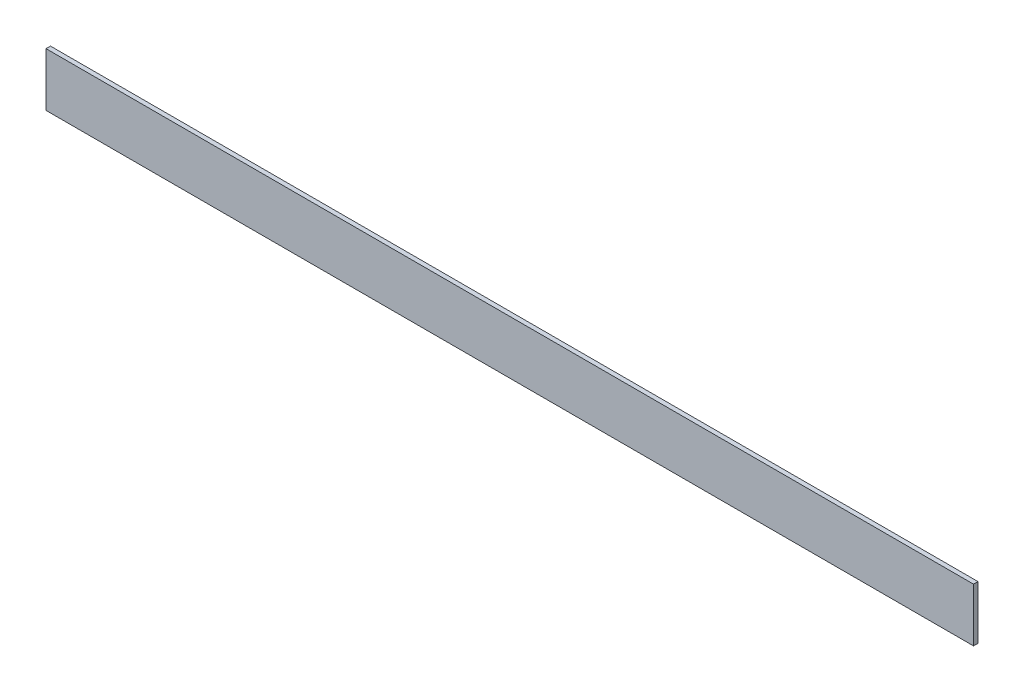
ISO-10303-21;
HEADER;
FILE_DESCRIPTION(('STEP AP214'),'2;1');
FILE_NAME('part.step','',(''),(''),'','','');
FILE_SCHEMA(('AUTOMOTIVE_DESIGN { 1 0 10303 214 1 1 1 1 }'));
ENDSEC;
DATA;
#1=APPLICATION_CONTEXT('core data for automotive mechanical design processes');
#2=APPLICATION_PROTOCOL_DEFINITION('international standard','automotive_design',2000,#1);
#3=PRODUCT_CONTEXT('',#1,'mechanical');
#4=PRODUCT('Part','Part','',(#3));
#5=PRODUCT_RELATED_PRODUCT_CATEGORY('part','',(#4));
#6=PRODUCT_DEFINITION_FORMATION('','',#4);
#7=PRODUCT_DEFINITION_CONTEXT('part definition',#1,'design');
#8=PRODUCT_DEFINITION('design','',#6,#7);
#9=PRODUCT_DEFINITION_SHAPE('','',#8);
#10=(LENGTH_UNIT() NAMED_UNIT(*) SI_UNIT(.MILLI.,.METRE.));
#11=(NAMED_UNIT(*) PLANE_ANGLE_UNIT() SI_UNIT($,.RADIAN.));
#12=(NAMED_UNIT(*) SI_UNIT($,.STERADIAN.) SOLID_ANGLE_UNIT());
#13=UNCERTAINTY_MEASURE_WITH_UNIT(LENGTH_MEASURE(1.E-05),#10,'distance_accuracy_value','');
#14=(GEOMETRIC_REPRESENTATION_CONTEXT(3) GLOBAL_UNCERTAINTY_ASSIGNED_CONTEXT((#13)) GLOBAL_UNIT_ASSIGNED_CONTEXT((#10,
#11,#12)) REPRESENTATION_CONTEXT('',''));
#15=CARTESIAN_POINT('',(0.,0.,0.));
#16=DIRECTION('',(0.,0.,1.));
#17=DIRECTION('',(1.,0.,0.));
#18=AXIS2_PLACEMENT_3D('',#15,#16,#17);
#19=CARTESIAN_POINT('',(1320.8,-38.1,-3.175));
#20=DIRECTION('',(0.,0.,1.));
#21=DIRECTION('',(1.,0.,0.));
#22=AXIS2_PLACEMENT_3D('',#19,#20,#21);
#23=PLANE('',#22);
#24=DIRECTION('',(0.,1.,0.));
#25=VECTOR('',#24,1.);
#26=CARTESIAN_POINT('',(0.,-38.1,-3.175));
#27=LINE('',#26,#25);
#28=CARTESIAN_POINT('',(0.,-38.1,-3.175));
#29=VERTEX_POINT('',#28);
#30=CARTESIAN_POINT('',(0.,38.1,-3.175));
#31=VERTEX_POINT('',#30);
#32=EDGE_CURVE('E98',#29,#31,#27,.T.);
#33=ORIENTED_EDGE('',*,*,#32,.T.);
#34=DIRECTION('',(-1.,0.,0.));
#35=VECTOR('',#34,1.);
#36=CARTESIAN_POINT('',(1320.8,38.1,-3.175));
#37=LINE('',#36,#35);
#38=CARTESIAN_POINT('',(1320.8,38.1,-3.175));
#39=VERTEX_POINT('',#38);
#40=EDGE_CURVE('E11',#39,#31,#37,.T.);
#41=ORIENTED_EDGE('',*,*,#40,.F.);
#42=DIRECTION('',(0.,1.,0.));
#43=VECTOR('',#42,1.);
#44=CARTESIAN_POINT('',(1320.8,-38.1,-3.175));
#45=LINE('',#44,#43);
#46=CARTESIAN_POINT('',(1320.8,-38.1,-3.175));
#47=VERTEX_POINT('',#46);
#48=EDGE_CURVE('E86',#47,#39,#45,.T.);
#49=ORIENTED_EDGE('',*,*,#48,.F.);
#50=DIRECTION('',(-1.,0.,0.));
#51=VECTOR('',#50,1.);
#52=CARTESIAN_POINT('',(1320.8,-38.1,-3.175));
#53=LINE('',#52,#51);
#54=EDGE_CURVE('E94',#47,#29,#53,.T.);
#55=ORIENTED_EDGE('',*,*,#54,.T.);
#56=EDGE_LOOP('',(#33,#41,#49,#55));
#57=FACE_BOUND('',#56,.T.);
#58=ADVANCED_FACE('F35',(#57),#23,.F.);
#59=CARTESIAN_POINT('',(1320.8,38.1,3.175));
#60=DIRECTION('',(0.,-1.,0.));
#61=DIRECTION('',(0.,0.,-1.));
#62=AXIS2_PLACEMENT_3D('',#59,#60,#61);
#63=PLANE('',#62);
#64=DIRECTION('',(0.,0.,1.));
#65=VECTOR('',#64,1.);
#66=CARTESIAN_POINT('',(0.,38.1,3.175));
#67=LINE('',#66,#65);
#68=CARTESIAN_POINT('',(0.,38.1,3.175));
#69=VERTEX_POINT('',#68);
#70=EDGE_CURVE('E90',#31,#69,#67,.T.);
#71=ORIENTED_EDGE('',*,*,#70,.T.);
#72=DIRECTION('',(-1.,0.,0.));
#73=VECTOR('',#72,1.);
#74=CARTESIAN_POINT('',(1320.8,38.1,3.175));
#75=LINE('',#74,#73);
#76=CARTESIAN_POINT('',(1320.8,38.1,3.175));
#77=VERTEX_POINT('',#76);
#78=EDGE_CURVE('E43',#77,#69,#75,.T.);
#79=ORIENTED_EDGE('',*,*,#78,.F.);
#80=DIRECTION('',(0.,0.,1.));
#81=VECTOR('',#80,1.);
#82=CARTESIAN_POINT('',(1320.8,38.1,3.175));
#83=LINE('',#82,#81);
#84=EDGE_CURVE('E81',#39,#77,#83,.T.);
#85=ORIENTED_EDGE('',*,*,#84,.F.);
#86=ORIENTED_EDGE('',*,*,#40,.T.);
#87=EDGE_LOOP('',(#71,#79,#85,#86));
#88=FACE_BOUND('',#87,.T.);
#89=ADVANCED_FACE('F89',(#88),#63,.F.);
#90=CARTESIAN_POINT('',(1320.8,-38.1,3.175));
#91=DIRECTION('',(0.,0.,-1.));
#92=DIRECTION('',(-1.,0.,0.));
#93=AXIS2_PLACEMENT_3D('',#90,#91,#92);
#94=PLANE('',#93);
#95=DIRECTION('',(0.,-1.,0.));
#96=VECTOR('',#95,1.);
#97=CARTESIAN_POINT('',(0.,-38.1,3.175));
#98=LINE('',#97,#96);
#99=CARTESIAN_POINT('',(0.,-38.1,3.175));
#100=VERTEX_POINT('',#99);
#101=EDGE_CURVE('E68',#69,#100,#98,.T.);
#102=ORIENTED_EDGE('',*,*,#101,.T.);
#103=DIRECTION('',(-1.,0.,0.));
#104=VECTOR('',#103,1.);
#105=CARTESIAN_POINT('',(1320.8,-38.1,3.175));
#106=LINE('',#105,#104);
#107=CARTESIAN_POINT('',(1320.8,-38.1,3.175));
#108=VERTEX_POINT('',#107);
#109=EDGE_CURVE('E91',#108,#100,#106,.T.);
#110=ORIENTED_EDGE('',*,*,#109,.F.);
#111=DIRECTION('',(0.,-1.,0.));
#112=VECTOR('',#111,1.);
#113=CARTESIAN_POINT('',(1320.8,-38.1,3.175));
#114=LINE('',#113,#112);
#115=EDGE_CURVE('E84',#77,#108,#114,.T.);
#116=ORIENTED_EDGE('',*,*,#115,.F.);
#117=ORIENTED_EDGE('',*,*,#78,.T.);
#118=EDGE_LOOP('',(#102,#110,#116,#117));
#119=FACE_BOUND('',#118,.T.);
#120=ADVANCED_FACE('F92',(#119),#94,.F.);
#121=CARTESIAN_POINT('',(1320.8,-38.1,3.175));
#122=DIRECTION('',(0.,1.,0.));
#123=DIRECTION('',(0.,0.,1.));
#124=AXIS2_PLACEMENT_3D('',#121,#122,#123);
#125=PLANE('',#124);
#126=DIRECTION('',(0.,0.,-1.));
#127=VECTOR('',#126,1.);
#128=CARTESIAN_POINT('',(0.,-38.1,3.175));
#129=LINE('',#128,#127);
#130=EDGE_CURVE('E74',#100,#29,#129,.T.);
#131=ORIENTED_EDGE('',*,*,#130,.T.);
#132=ORIENTED_EDGE('',*,*,#54,.F.);
#133=DIRECTION('',(0.,0.,-1.));
#134=VECTOR('',#133,1.);
#135=CARTESIAN_POINT('',(1320.8,-38.1,3.175));
#136=LINE('',#135,#134);
#137=EDGE_CURVE('E51',#108,#47,#136,.T.);
#138=ORIENTED_EDGE('',*,*,#137,.F.);
#139=ORIENTED_EDGE('',*,*,#109,.T.);
#140=EDGE_LOOP('',(#131,#132,#138,#139));
#141=FACE_BOUND('',#140,.T.);
#142=ADVANCED_FACE('F105',(#141),#125,.F.);
#143=CARTESIAN_POINT('',(1320.8,0.,0.));
#144=DIRECTION('',(-1.,0.,0.));
#145=DIRECTION('',(0.,0.,1.));
#146=AXIS2_PLACEMENT_3D('',#143,#144,#145);
#147=PLANE('',#146);
#148=ORIENTED_EDGE('',*,*,#48,.T.);
#149=ORIENTED_EDGE('',*,*,#84,.T.);
#150=ORIENTED_EDGE('',*,*,#115,.T.);
#151=ORIENTED_EDGE('',*,*,#137,.T.);
#152=EDGE_LOOP('',(#148,#149,#150,#151));
#153=FACE_BOUND('',#152,.T.);
#154=ADVANCED_FACE('F82',(#153),#147,.F.);
#155=CARTESIAN_POINT('',(0.,0.,0.));
#156=DIRECTION('',(-1.,0.,0.));
#157=DIRECTION('',(0.,0.,1.));
#158=AXIS2_PLACEMENT_3D('',#155,#156,#157);
#159=PLANE('',#158);
#160=ORIENTED_EDGE('',*,*,#32,.F.);
#161=ORIENTED_EDGE('',*,*,#130,.F.);
#162=ORIENTED_EDGE('',*,*,#101,.F.);
#163=ORIENTED_EDGE('',*,*,#70,.F.);
#164=EDGE_LOOP('',(#160,#161,#162,#163));
#165=FACE_BOUND('',#164,.T.);
#166=ADVANCED_FACE('F108',(#165),#159,.T.);
#167=CLOSED_SHELL('',(#58,#89,#120,#142,#154,#166));
#168=MANIFOLD_SOLID_BREP('B2',#167);
#169=ADVANCED_BREP_SHAPE_REPRESENTATION('',(#18,#168),#14);
#170=SHAPE_DEFINITION_REPRESENTATION(#9,#169);
ENDSEC;
END-ISO-10303-21;
